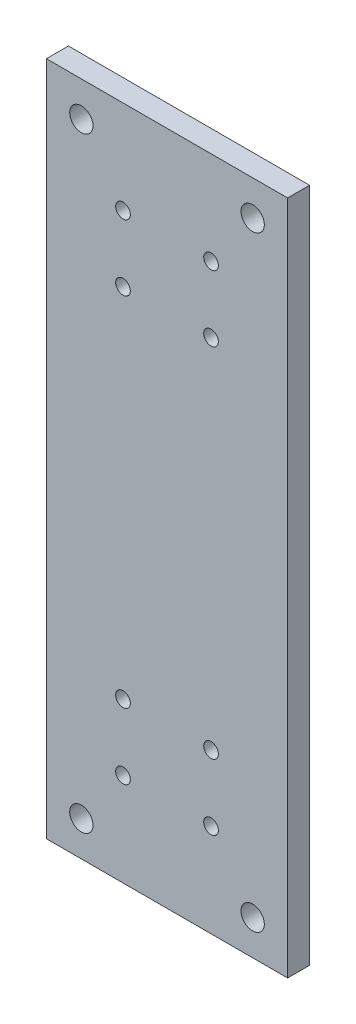
ISO-10303-21;
HEADER;
FILE_DESCRIPTION(('STEP AP214'),'2;1');
FILE_NAME('part.step','',(''),(''),'','','');
FILE_SCHEMA(('AUTOMOTIVE_DESIGN { 1 0 10303 214 1 1 1 1 }'));
ENDSEC;
DATA;
#1=APPLICATION_CONTEXT('core data for automotive mechanical design processes');
#2=APPLICATION_PROTOCOL_DEFINITION('international standard','automotive_design',2000,#1);
#3=PRODUCT_CONTEXT('',#1,'mechanical');
#4=PRODUCT('Part','Part','',(#3));
#5=PRODUCT_RELATED_PRODUCT_CATEGORY('part','',(#4));
#6=PRODUCT_DEFINITION_FORMATION('','',#4);
#7=PRODUCT_DEFINITION_CONTEXT('part definition',#1,'design');
#8=PRODUCT_DEFINITION('design','',#6,#7);
#9=PRODUCT_DEFINITION_SHAPE('','',#8);
#10=(LENGTH_UNIT() NAMED_UNIT(*) SI_UNIT(.MILLI.,.METRE.));
#11=(NAMED_UNIT(*) PLANE_ANGLE_UNIT() SI_UNIT($,.RADIAN.));
#12=(NAMED_UNIT(*) SI_UNIT($,.STERADIAN.) SOLID_ANGLE_UNIT());
#13=UNCERTAINTY_MEASURE_WITH_UNIT(LENGTH_MEASURE(1.E-05),#10,'distance_accuracy_value','');
#14=(GEOMETRIC_REPRESENTATION_CONTEXT(3) GLOBAL_UNCERTAINTY_ASSIGNED_CONTEXT((#13)) GLOBAL_UNIT_ASSIGNED_CONTEXT((#10,
#11,#12)) REPRESENTATION_CONTEXT('',''));
#15=CARTESIAN_POINT('',(0.,0.,0.));
#16=DIRECTION('',(0.,0.,1.));
#17=DIRECTION('',(1.,0.,0.));
#18=AXIS2_PLACEMENT_3D('',#15,#16,#17);
#19=CARTESIAN_POINT('',(0.,0.,5.9944));
#20=DIRECTION('',(0.,0.,-1.));
#21=DIRECTION('',(-1.,0.,0.));
#22=AXIS2_PLACEMENT_3D('',#19,#20,#21);
#23=PLANE('',#22);
#24=CARTESIAN_POINT('',(44.875,25.4,5.9944));
#25=DIRECTION('',(0.,0.,1.));
#26=DIRECTION('',(1.,0.,0.));
#27=AXIS2_PLACEMENT_3D('',#24,#25,#26);
#28=CIRCLE('',#27,2.);
#29=CARTESIAN_POINT('',(46.875,25.4,5.9944));
#30=VERTEX_POINT('',#29);
#31=EDGE_CURVE('E168',#30,#30,#28,.T.);
#32=ORIENTED_EDGE('',*,*,#31,.F.);
#33=EDGE_LOOP('',(#32));
#34=FACE_BOUND('',#33,.T.);
#35=CARTESIAN_POINT('',(20.875,43.4,5.9944));
#36=DIRECTION('',(0.,0.,1.));
#37=DIRECTION('',(1.,0.,0.));
#38=AXIS2_PLACEMENT_3D('',#35,#36,#37);
#39=CIRCLE('',#38,2.00000000000001);
#40=CARTESIAN_POINT('',(22.875,43.4,5.9944));
#41=VERTEX_POINT('',#40);
#42=EDGE_CURVE('E156',#41,#41,#39,.T.);
#43=ORIENTED_EDGE('',*,*,#42,.F.);
#44=EDGE_LOOP('',(#43));
#45=FACE_BOUND('',#44,.T.);
#46=CARTESIAN_POINT('',(44.875,140.75,5.9944));
#47=DIRECTION('',(0.,0.,1.));
#48=DIRECTION('',(1.,0.,0.));
#49=AXIS2_PLACEMENT_3D('',#46,#47,#48);
#50=CIRCLE('',#49,2.);
#51=CARTESIAN_POINT('',(46.875,140.75,5.9944));
#52=VERTEX_POINT('',#51);
#53=EDGE_CURVE('E144',#52,#52,#50,.T.);
#54=ORIENTED_EDGE('',*,*,#53,.F.);
#55=EDGE_LOOP('',(#54));
#56=FACE_BOUND('',#55,.T.);
#57=CARTESIAN_POINT('',(20.875,158.75,5.9944));
#58=DIRECTION('',(0.,0.,1.));
#59=DIRECTION('',(1.,0.,0.));
#60=AXIS2_PLACEMENT_3D('',#57,#58,#59);
#61=CIRCLE('',#60,2.);
#62=CARTESIAN_POINT('',(22.875,158.75,5.9944));
#63=VERTEX_POINT('',#62);
#64=EDGE_CURVE('E132',#63,#63,#61,.T.);
#65=ORIENTED_EDGE('',*,*,#64,.F.);
#66=EDGE_LOOP('',(#65));
#67=FACE_BOUND('',#66,.T.);
#68=CARTESIAN_POINT('',(56.225,174.625,5.9944));
#69=DIRECTION('',(0.,0.,1.));
#70=DIRECTION('',(1.,0.,0.));
#71=AXIS2_PLACEMENT_3D('',#68,#69,#70);
#72=CIRCLE('',#71,3.175);
#73=CARTESIAN_POINT('',(59.4,174.625,5.9944));
#74=VERTEX_POINT('',#73);
#75=EDGE_CURVE('E120',#74,#74,#72,.T.);
#76=ORIENTED_EDGE('',*,*,#75,.F.);
#77=EDGE_LOOP('',(#76));
#78=FACE_BOUND('',#77,.T.);
#79=CARTESIAN_POINT('',(9.525,9.525,5.9944));
#80=DIRECTION('',(0.,0.,1.));
#81=DIRECTION('',(1.,0.,0.));
#82=AXIS2_PLACEMENT_3D('',#79,#80,#81);
#83=CIRCLE('',#82,3.175);
#84=CARTESIAN_POINT('',(12.7,9.525,5.9944));
#85=VERTEX_POINT('',#84);
#86=EDGE_CURVE('E99',#85,#85,#83,.T.);
#87=ORIENTED_EDGE('',*,*,#86,.F.);
#88=EDGE_LOOP('',(#87));
#89=FACE_BOUND('',#88,.T.);
#90=DIRECTION('',(0.,-1.,0.));
#91=VECTOR('',#90,1.);
#92=CARTESIAN_POINT('',(0.,0.,5.9944));
#93=LINE('',#92,#91);
#94=CARTESIAN_POINT('',(0.,184.15,5.9944));
#95=VERTEX_POINT('',#94);
#96=CARTESIAN_POINT('',(0.,0.,5.9944));
#97=VERTEX_POINT('',#96);
#98=EDGE_CURVE('E84',#95,#97,#93,.T.);
#99=ORIENTED_EDGE('',*,*,#98,.T.);
#100=DIRECTION('',(1.,0.,0.));
#101=VECTOR('',#100,1.);
#102=CARTESIAN_POINT('',(0.,0.,5.9944));
#103=LINE('',#102,#101);
#104=CARTESIAN_POINT('',(65.75,0.,5.9944));
#105=VERTEX_POINT('',#104);
#106=EDGE_CURVE('E79',#97,#105,#103,.T.);
#107=ORIENTED_EDGE('',*,*,#106,.T.);
#108=DIRECTION('',(0.,1.,0.));
#109=VECTOR('',#108,1.);
#110=CARTESIAN_POINT('',(65.75,0.,5.9944));
#111=LINE('',#110,#109);
#112=CARTESIAN_POINT('',(65.75,184.15,5.9944));
#113=VERTEX_POINT('',#112);
#114=EDGE_CURVE('E82',#105,#113,#111,.T.);
#115=ORIENTED_EDGE('',*,*,#114,.T.);
#116=DIRECTION('',(-1.,0.,0.));
#117=VECTOR('',#116,1.);
#118=CARTESIAN_POINT('',(0.,184.15,5.9944));
#119=LINE('',#118,#117);
#120=EDGE_CURVE('E49',#113,#95,#119,.T.);
#121=ORIENTED_EDGE('',*,*,#120,.T.);
#122=EDGE_LOOP('',(#99,#107,#115,#121));
#123=FACE_BOUND('',#122,.T.);
#124=CARTESIAN_POINT('',(56.225,9.525,5.9944));
#125=DIRECTION('',(0.,0.,1.));
#126=DIRECTION('',(1.,0.,0.));
#127=AXIS2_PLACEMENT_3D('',#124,#125,#126);
#128=CIRCLE('',#127,3.175);
#129=CARTESIAN_POINT('',(59.4,9.525,5.9944));
#130=VERTEX_POINT('',#129);
#131=EDGE_CURVE('E114',#130,#130,#128,.T.);
#132=ORIENTED_EDGE('',*,*,#131,.F.);
#133=EDGE_LOOP('',(#132));
#134=FACE_BOUND('',#133,.T.);
#135=CARTESIAN_POINT('',(9.525,174.625,5.9944));
#136=DIRECTION('',(0.,0.,1.));
#137=DIRECTION('',(1.,0.,0.));
#138=AXIS2_PLACEMENT_3D('',#135,#136,#137);
#139=CIRCLE('',#138,3.175);
#140=CARTESIAN_POINT('',(12.7,174.625,5.9944));
#141=VERTEX_POINT('',#140);
#142=EDGE_CURVE('E126',#141,#141,#139,.T.);
#143=ORIENTED_EDGE('',*,*,#142,.F.);
#144=EDGE_LOOP('',(#143));
#145=FACE_BOUND('',#144,.T.);
#146=CARTESIAN_POINT('',(44.875,158.75,5.9944));
#147=DIRECTION('',(0.,0.,1.));
#148=DIRECTION('',(1.,0.,0.));
#149=AXIS2_PLACEMENT_3D('',#146,#147,#148);
#150=CIRCLE('',#149,2.);
#151=CARTESIAN_POINT('',(46.875,158.75,5.9944));
#152=VERTEX_POINT('',#151);
#153=EDGE_CURVE('E138',#152,#152,#150,.T.);
#154=ORIENTED_EDGE('',*,*,#153,.F.);
#155=EDGE_LOOP('',(#154));
#156=FACE_BOUND('',#155,.T.);
#157=CARTESIAN_POINT('',(20.875,140.75,5.9944));
#158=DIRECTION('',(0.,0.,1.));
#159=DIRECTION('',(1.,0.,0.));
#160=AXIS2_PLACEMENT_3D('',#157,#158,#159);
#161=CIRCLE('',#160,2.);
#162=CARTESIAN_POINT('',(22.875,140.75,5.9944));
#163=VERTEX_POINT('',#162);
#164=EDGE_CURVE('E150',#163,#163,#161,.T.);
#165=ORIENTED_EDGE('',*,*,#164,.F.);
#166=EDGE_LOOP('',(#165));
#167=FACE_BOUND('',#166,.T.);
#168=CARTESIAN_POINT('',(44.875,43.4,5.9944));
#169=DIRECTION('',(0.,0.,1.));
#170=DIRECTION('',(1.,0.,0.));
#171=AXIS2_PLACEMENT_3D('',#168,#169,#170);
#172=CIRCLE('',#171,2.);
#173=CARTESIAN_POINT('',(46.875,43.4,5.9944));
#174=VERTEX_POINT('',#173);
#175=EDGE_CURVE('E162',#174,#174,#172,.T.);
#176=ORIENTED_EDGE('',*,*,#175,.F.);
#177=EDGE_LOOP('',(#176));
#178=FACE_BOUND('',#177,.T.);
#179=CARTESIAN_POINT('',(20.875,25.4,5.9944));
#180=DIRECTION('',(0.,0.,1.));
#181=DIRECTION('',(1.,0.,0.));
#182=AXIS2_PLACEMENT_3D('',#179,#180,#181);
#183=CIRCLE('',#182,2.00000000000001);
#184=CARTESIAN_POINT('',(22.875,25.4,5.9944));
#185=VERTEX_POINT('',#184);
#186=EDGE_CURVE('E174',#185,#185,#183,.T.);
#187=ORIENTED_EDGE('',*,*,#186,.F.);
#188=EDGE_LOOP('',(#187));
#189=FACE_BOUND('',#188,.T.);
#190=ADVANCED_FACE('F32',(#34,#45,#56,#67,#78,#89,#123,#134,#145,#156,#167,#178,#189),#23,.F.);
#191=CARTESIAN_POINT('',(0.,0.,0.));
#192=DIRECTION('',(0.,0.,-1.));
#193=DIRECTION('',(-1.,0.,0.));
#194=AXIS2_PLACEMENT_3D('',#191,#192,#193);
#195=PLANE('',#194);
#196=CARTESIAN_POINT('',(44.875,25.4,0.));
#197=DIRECTION('',(0.,0.,1.));
#198=DIRECTION('',(1.,0.,0.));
#199=AXIS2_PLACEMENT_3D('',#196,#197,#198);
#200=CIRCLE('',#199,2.);
#201=CARTESIAN_POINT('',(46.875,25.4,0.));
#202=VERTEX_POINT('',#201);
#203=EDGE_CURVE('E171',#202,#202,#200,.T.);
#204=ORIENTED_EDGE('',*,*,#203,.T.);
#205=EDGE_LOOP('',(#204));
#206=FACE_BOUND('',#205,.T.);
#207=CARTESIAN_POINT('',(20.875,43.4,0.));
#208=DIRECTION('',(0.,0.,1.));
#209=DIRECTION('',(1.,0.,0.));
#210=AXIS2_PLACEMENT_3D('',#207,#208,#209);
#211=CIRCLE('',#210,2.00000000000001);
#212=CARTESIAN_POINT('',(22.875,43.4,0.));
#213=VERTEX_POINT('',#212);
#214=EDGE_CURVE('E159',#213,#213,#211,.T.);
#215=ORIENTED_EDGE('',*,*,#214,.T.);
#216=EDGE_LOOP('',(#215));
#217=FACE_BOUND('',#216,.T.);
#218=CARTESIAN_POINT('',(44.875,140.75,0.));
#219=DIRECTION('',(0.,0.,1.));
#220=DIRECTION('',(1.,0.,0.));
#221=AXIS2_PLACEMENT_3D('',#218,#219,#220);
#222=CIRCLE('',#221,2.);
#223=CARTESIAN_POINT('',(46.875,140.75,0.));
#224=VERTEX_POINT('',#223);
#225=EDGE_CURVE('E147',#224,#224,#222,.T.);
#226=ORIENTED_EDGE('',*,*,#225,.T.);
#227=EDGE_LOOP('',(#226));
#228=FACE_BOUND('',#227,.T.);
#229=CARTESIAN_POINT('',(20.875,158.75,0.));
#230=DIRECTION('',(0.,0.,1.));
#231=DIRECTION('',(1.,0.,0.));
#232=AXIS2_PLACEMENT_3D('',#229,#230,#231);
#233=CIRCLE('',#232,2.);
#234=CARTESIAN_POINT('',(22.875,158.75,0.));
#235=VERTEX_POINT('',#234);
#236=EDGE_CURVE('E135',#235,#235,#233,.T.);
#237=ORIENTED_EDGE('',*,*,#236,.T.);
#238=EDGE_LOOP('',(#237));
#239=FACE_BOUND('',#238,.T.);
#240=CARTESIAN_POINT('',(56.225,174.625,0.));
#241=DIRECTION('',(0.,0.,1.));
#242=DIRECTION('',(1.,0.,0.));
#243=AXIS2_PLACEMENT_3D('',#240,#241,#242);
#244=CIRCLE('',#243,3.175);
#245=CARTESIAN_POINT('',(59.4,174.625,0.));
#246=VERTEX_POINT('',#245);
#247=EDGE_CURVE('E123',#246,#246,#244,.T.);
#248=ORIENTED_EDGE('',*,*,#247,.T.);
#249=EDGE_LOOP('',(#248));
#250=FACE_BOUND('',#249,.T.);
#251=CARTESIAN_POINT('',(9.525,9.525,0.));
#252=DIRECTION('',(0.,0.,1.));
#253=DIRECTION('',(1.,0.,0.));
#254=AXIS2_PLACEMENT_3D('',#251,#252,#253);
#255=CIRCLE('',#254,3.175);
#256=CARTESIAN_POINT('',(12.7,9.525,0.));
#257=VERTEX_POINT('',#256);
#258=EDGE_CURVE('E111',#257,#257,#255,.T.);
#259=ORIENTED_EDGE('',*,*,#258,.T.);
#260=EDGE_LOOP('',(#259));
#261=FACE_BOUND('',#260,.T.);
#262=DIRECTION('',(0.,-1.,0.));
#263=VECTOR('',#262,1.);
#264=CARTESIAN_POINT('',(0.,0.,0.));
#265=LINE('',#264,#263);
#266=CARTESIAN_POINT('',(0.,184.15,0.));
#267=VERTEX_POINT('',#266);
#268=CARTESIAN_POINT('',(0.,0.,0.));
#269=VERTEX_POINT('',#268);
#270=EDGE_CURVE('E96',#267,#269,#265,.T.);
#271=ORIENTED_EDGE('',*,*,#270,.F.);
#272=DIRECTION('',(-1.,0.,0.));
#273=VECTOR('',#272,1.);
#274=CARTESIAN_POINT('',(0.,184.15,0.));
#275=LINE('',#274,#273);
#276=CARTESIAN_POINT('',(65.75,184.15,0.));
#277=VERTEX_POINT('',#276);
#278=EDGE_CURVE('E72',#277,#267,#275,.T.);
#279=ORIENTED_EDGE('',*,*,#278,.F.);
#280=DIRECTION('',(0.,1.,0.));
#281=VECTOR('',#280,1.);
#282=CARTESIAN_POINT('',(65.75,0.,0.));
#283=LINE('',#282,#281);
#284=CARTESIAN_POINT('',(65.75,0.,0.));
#285=VERTEX_POINT('',#284);
#286=EDGE_CURVE('E66',#285,#277,#283,.T.);
#287=ORIENTED_EDGE('',*,*,#286,.F.);
#288=DIRECTION('',(1.,0.,0.));
#289=VECTOR('',#288,1.);
#290=CARTESIAN_POINT('',(0.,0.,0.));
#291=LINE('',#290,#289);
#292=EDGE_CURVE('E88',#269,#285,#291,.T.);
#293=ORIENTED_EDGE('',*,*,#292,.F.);
#294=EDGE_LOOP('',(#271,#279,#287,#293));
#295=FACE_BOUND('',#294,.T.);
#296=CARTESIAN_POINT('',(56.225,9.525,0.));
#297=DIRECTION('',(0.,0.,1.));
#298=DIRECTION('',(1.,0.,0.));
#299=AXIS2_PLACEMENT_3D('',#296,#297,#298);
#300=CIRCLE('',#299,3.175);
#301=CARTESIAN_POINT('',(59.4,9.525,0.));
#302=VERTEX_POINT('',#301);
#303=EDGE_CURVE('E117',#302,#302,#300,.T.);
#304=ORIENTED_EDGE('',*,*,#303,.T.);
#305=EDGE_LOOP('',(#304));
#306=FACE_BOUND('',#305,.T.);
#307=CARTESIAN_POINT('',(9.525,174.625,0.));
#308=DIRECTION('',(0.,0.,1.));
#309=DIRECTION('',(1.,0.,0.));
#310=AXIS2_PLACEMENT_3D('',#307,#308,#309);
#311=CIRCLE('',#310,3.175);
#312=CARTESIAN_POINT('',(12.7,174.625,0.));
#313=VERTEX_POINT('',#312);
#314=EDGE_CURVE('E129',#313,#313,#311,.T.);
#315=ORIENTED_EDGE('',*,*,#314,.T.);
#316=EDGE_LOOP('',(#315));
#317=FACE_BOUND('',#316,.T.);
#318=CARTESIAN_POINT('',(44.875,158.75,0.));
#319=DIRECTION('',(0.,0.,1.));
#320=DIRECTION('',(1.,0.,0.));
#321=AXIS2_PLACEMENT_3D('',#318,#319,#320);
#322=CIRCLE('',#321,2.);
#323=CARTESIAN_POINT('',(46.875,158.75,0.));
#324=VERTEX_POINT('',#323);
#325=EDGE_CURVE('E141',#324,#324,#322,.T.);
#326=ORIENTED_EDGE('',*,*,#325,.T.);
#327=EDGE_LOOP('',(#326));
#328=FACE_BOUND('',#327,.T.);
#329=CARTESIAN_POINT('',(20.875,140.75,0.));
#330=DIRECTION('',(0.,0.,1.));
#331=DIRECTION('',(1.,0.,0.));
#332=AXIS2_PLACEMENT_3D('',#329,#330,#331);
#333=CIRCLE('',#332,2.);
#334=CARTESIAN_POINT('',(22.875,140.75,0.));
#335=VERTEX_POINT('',#334);
#336=EDGE_CURVE('E153',#335,#335,#333,.T.);
#337=ORIENTED_EDGE('',*,*,#336,.T.);
#338=EDGE_LOOP('',(#337));
#339=FACE_BOUND('',#338,.T.);
#340=CARTESIAN_POINT('',(44.875,43.4,0.));
#341=DIRECTION('',(0.,0.,1.));
#342=DIRECTION('',(1.,0.,0.));
#343=AXIS2_PLACEMENT_3D('',#340,#341,#342);
#344=CIRCLE('',#343,2.);
#345=CARTESIAN_POINT('',(46.875,43.4,0.));
#346=VERTEX_POINT('',#345);
#347=EDGE_CURVE('E165',#346,#346,#344,.T.);
#348=ORIENTED_EDGE('',*,*,#347,.T.);
#349=EDGE_LOOP('',(#348));
#350=FACE_BOUND('',#349,.T.);
#351=CARTESIAN_POINT('',(20.875,25.4,0.));
#352=DIRECTION('',(0.,0.,1.));
#353=DIRECTION('',(1.,0.,0.));
#354=AXIS2_PLACEMENT_3D('',#351,#352,#353);
#355=CIRCLE('',#354,2.00000000000001);
#356=CARTESIAN_POINT('',(22.875,25.4,0.));
#357=VERTEX_POINT('',#356);
#358=EDGE_CURVE('E177',#357,#357,#355,.T.);
#359=ORIENTED_EDGE('',*,*,#358,.T.);
#360=EDGE_LOOP('',(#359));
#361=FACE_BOUND('',#360,.T.);
#362=ADVANCED_FACE('F107',(#206,#217,#228,#239,#250,#261,#295,#306,#317,#328,#339,#350,#361),
#195,.T.);
#363=CARTESIAN_POINT('',(0.,0.,5.9944));
#364=DIRECTION('',(1.,0.,0.));
#365=DIRECTION('',(0.,0.,-1.));
#366=AXIS2_PLACEMENT_3D('',#363,#364,#365);
#367=PLANE('',#366);
#368=ORIENTED_EDGE('',*,*,#270,.T.);
#369=DIRECTION('',(0.,0.,-1.));
#370=VECTOR('',#369,1.);
#371=CARTESIAN_POINT('',(0.,0.,5.9944));
#372=LINE('',#371,#370);
#373=EDGE_CURVE('E11',#97,#269,#372,.T.);
#374=ORIENTED_EDGE('',*,*,#373,.F.);
#375=ORIENTED_EDGE('',*,*,#98,.F.);
#376=DIRECTION('',(0.,0.,-1.));
#377=VECTOR('',#376,1.);
#378=CARTESIAN_POINT('',(0.,184.15,5.9944));
#379=LINE('',#378,#377);
#380=EDGE_CURVE('E92',#95,#267,#379,.T.);
#381=ORIENTED_EDGE('',*,*,#380,.T.);
#382=EDGE_LOOP('',(#368,#374,#375,#381));
#383=FACE_BOUND('',#382,.T.);
#384=ADVANCED_FACE('F34',(#383),#367,.F.);
#385=CARTESIAN_POINT('',(0.,0.,5.9944));
#386=DIRECTION('',(0.,1.,0.));
#387=DIRECTION('',(0.,0.,1.));
#388=AXIS2_PLACEMENT_3D('',#385,#386,#387);
#389=PLANE('',#388);
#390=ORIENTED_EDGE('',*,*,#292,.T.);
#391=DIRECTION('',(0.,0.,-1.));
#392=VECTOR('',#391,1.);
#393=CARTESIAN_POINT('',(65.75,0.,5.9944));
#394=LINE('',#393,#392);
#395=EDGE_CURVE('E41',#105,#285,#394,.T.);
#396=ORIENTED_EDGE('',*,*,#395,.F.);
#397=ORIENTED_EDGE('',*,*,#106,.F.);
#398=ORIENTED_EDGE('',*,*,#373,.T.);
#399=EDGE_LOOP('',(#390,#396,#397,#398));
#400=FACE_BOUND('',#399,.T.);
#401=ADVANCED_FACE('F87',(#400),#389,.F.);
#402=CARTESIAN_POINT('',(65.75,0.,5.9944));
#403=DIRECTION('',(-1.,0.,0.));
#404=DIRECTION('',(0.,0.,1.));
#405=AXIS2_PLACEMENT_3D('',#402,#403,#404);
#406=PLANE('',#405);
#407=ORIENTED_EDGE('',*,*,#286,.T.);
#408=DIRECTION('',(0.,0.,-1.));
#409=VECTOR('',#408,1.);
#410=CARTESIAN_POINT('',(65.75,184.15,5.9944));
#411=LINE('',#410,#409);
#412=EDGE_CURVE('E89',#113,#277,#411,.T.);
#413=ORIENTED_EDGE('',*,*,#412,.F.);
#414=ORIENTED_EDGE('',*,*,#114,.F.);
#415=ORIENTED_EDGE('',*,*,#395,.T.);
#416=EDGE_LOOP('',(#407,#413,#414,#415));
#417=FACE_BOUND('',#416,.T.);
#418=ADVANCED_FACE('F90',(#417),#406,.F.);
#419=CARTESIAN_POINT('',(0.,184.15,5.9944));
#420=DIRECTION('',(0.,-1.,0.));
#421=DIRECTION('',(0.,0.,-1.));
#422=AXIS2_PLACEMENT_3D('',#419,#420,#421);
#423=PLANE('',#422);
#424=ORIENTED_EDGE('',*,*,#278,.T.);
#425=ORIENTED_EDGE('',*,*,#380,.F.);
#426=ORIENTED_EDGE('',*,*,#120,.F.);
#427=ORIENTED_EDGE('',*,*,#412,.T.);
#428=EDGE_LOOP('',(#424,#425,#426,#427));
#429=FACE_BOUND('',#428,.T.);
#430=ADVANCED_FACE('F104',(#429),#423,.F.);
#431=CARTESIAN_POINT('',(9.525,9.525,5.9944));
#432=DIRECTION('',(0.,0.,-1.));
#433=DIRECTION('',(-1.,0.,0.));
#434=AXIS2_PLACEMENT_3D('',#431,#432,#433);
#435=CYLINDRICAL_SURFACE('',#434,3.175);
#436=ORIENTED_EDGE('',*,*,#86,.T.);
#437=EDGE_LOOP('',(#436));
#438=FACE_BOUND('',#437,.T.);
#439=ORIENTED_EDGE('',*,*,#258,.F.);
#440=EDGE_LOOP('',(#439));
#441=FACE_BOUND('',#440,.T.);
#442=ADVANCED_FACE('F197',(#438,#441),#435,.F.);
#443=CARTESIAN_POINT('',(56.225,9.525,5.9944));
#444=DIRECTION('',(0.,0.,-1.));
#445=DIRECTION('',(-1.,0.,0.));
#446=AXIS2_PLACEMENT_3D('',#443,#444,#445);
#447=CYLINDRICAL_SURFACE('',#446,3.175);
#448=ORIENTED_EDGE('',*,*,#131,.T.);
#449=EDGE_LOOP('',(#448));
#450=FACE_BOUND('',#449,.T.);
#451=ORIENTED_EDGE('',*,*,#303,.F.);
#452=EDGE_LOOP('',(#451));
#453=FACE_BOUND('',#452,.T.);
#454=ADVANCED_FACE('F243',(#450,#453),#447,.F.);
#455=CARTESIAN_POINT('',(56.225,174.625,5.9944));
#456=DIRECTION('',(0.,0.,-1.));
#457=DIRECTION('',(-1.,0.,0.));
#458=AXIS2_PLACEMENT_3D('',#455,#456,#457);
#459=CYLINDRICAL_SURFACE('',#458,3.175);
#460=ORIENTED_EDGE('',*,*,#75,.T.);
#461=EDGE_LOOP('',(#460));
#462=FACE_BOUND('',#461,.T.);
#463=ORIENTED_EDGE('',*,*,#247,.F.);
#464=EDGE_LOOP('',(#463));
#465=FACE_BOUND('',#464,.T.);
#466=ADVANCED_FACE('F251',(#462,#465),#459,.F.);
#467=CARTESIAN_POINT('',(9.525,174.625,5.9944));
#468=DIRECTION('',(0.,0.,-1.));
#469=DIRECTION('',(-1.,0.,0.));
#470=AXIS2_PLACEMENT_3D('',#467,#468,#469);
#471=CYLINDRICAL_SURFACE('',#470,3.175);
#472=ORIENTED_EDGE('',*,*,#142,.T.);
#473=EDGE_LOOP('',(#472));
#474=FACE_BOUND('',#473,.T.);
#475=ORIENTED_EDGE('',*,*,#314,.F.);
#476=EDGE_LOOP('',(#475));
#477=FACE_BOUND('',#476,.T.);
#478=ADVANCED_FACE('F259',(#474,#477),#471,.F.);
#479=CARTESIAN_POINT('',(20.875,158.75,5.9944));
#480=DIRECTION('',(0.,0.,-1.));
#481=DIRECTION('',(-1.,0.,0.));
#482=AXIS2_PLACEMENT_3D('',#479,#480,#481);
#483=CYLINDRICAL_SURFACE('',#482,2.);
#484=ORIENTED_EDGE('',*,*,#64,.T.);
#485=EDGE_LOOP('',(#484));
#486=FACE_BOUND('',#485,.T.);
#487=ORIENTED_EDGE('',*,*,#236,.F.);
#488=EDGE_LOOP('',(#487));
#489=FACE_BOUND('',#488,.T.);
#490=ADVANCED_FACE('F268',(#486,#489),#483,.F.);
#491=CARTESIAN_POINT('',(44.875,158.75,5.9944));
#492=DIRECTION('',(0.,0.,-1.));
#493=DIRECTION('',(-1.,0.,0.));
#494=AXIS2_PLACEMENT_3D('',#491,#492,#493);
#495=CYLINDRICAL_SURFACE('',#494,2.);
#496=ORIENTED_EDGE('',*,*,#153,.T.);
#497=EDGE_LOOP('',(#496));
#498=FACE_BOUND('',#497,.T.);
#499=ORIENTED_EDGE('',*,*,#325,.F.);
#500=EDGE_LOOP('',(#499));
#501=FACE_BOUND('',#500,.T.);
#502=ADVANCED_FACE('F277',(#498,#501),#495,.F.);
#503=CARTESIAN_POINT('',(44.875,140.75,5.9944));
#504=DIRECTION('',(0.,0.,-1.));
#505=DIRECTION('',(-1.,0.,0.));
#506=AXIS2_PLACEMENT_3D('',#503,#504,#505);
#507=CYLINDRICAL_SURFACE('',#506,2.);
#508=ORIENTED_EDGE('',*,*,#53,.T.);
#509=EDGE_LOOP('',(#508));
#510=FACE_BOUND('',#509,.T.);
#511=ORIENTED_EDGE('',*,*,#225,.F.);
#512=EDGE_LOOP('',(#511));
#513=FACE_BOUND('',#512,.T.);
#514=ADVANCED_FACE('F286',(#510,#513),#507,.F.);
#515=CARTESIAN_POINT('',(20.875,140.75,5.9944));
#516=DIRECTION('',(0.,0.,-1.));
#517=DIRECTION('',(-1.,0.,0.));
#518=AXIS2_PLACEMENT_3D('',#515,#516,#517);
#519=CYLINDRICAL_SURFACE('',#518,2.);
#520=ORIENTED_EDGE('',*,*,#164,.T.);
#521=EDGE_LOOP('',(#520));
#522=FACE_BOUND('',#521,.T.);
#523=ORIENTED_EDGE('',*,*,#336,.F.);
#524=EDGE_LOOP('',(#523));
#525=FACE_BOUND('',#524,.T.);
#526=ADVANCED_FACE('F295',(#522,#525),#519,.F.);
#527=CARTESIAN_POINT('',(20.875,43.4,5.9944));
#528=DIRECTION('',(0.,0.,-1.));
#529=DIRECTION('',(-1.,0.,0.));
#530=AXIS2_PLACEMENT_3D('',#527,#528,#529);
#531=CYLINDRICAL_SURFACE('',#530,2.00000000000001);
#532=ORIENTED_EDGE('',*,*,#42,.T.);
#533=EDGE_LOOP('',(#532));
#534=FACE_BOUND('',#533,.T.);
#535=ORIENTED_EDGE('',*,*,#214,.F.);
#536=EDGE_LOOP('',(#535));
#537=FACE_BOUND('',#536,.T.);
#538=ADVANCED_FACE('F304',(#534,#537),#531,.F.);
#539=CARTESIAN_POINT('',(44.875,43.4,5.9944));
#540=DIRECTION('',(0.,0.,-1.));
#541=DIRECTION('',(-1.,0.,0.));
#542=AXIS2_PLACEMENT_3D('',#539,#540,#541);
#543=CYLINDRICAL_SURFACE('',#542,2.);
#544=ORIENTED_EDGE('',*,*,#175,.T.);
#545=EDGE_LOOP('',(#544));
#546=FACE_BOUND('',#545,.T.);
#547=ORIENTED_EDGE('',*,*,#347,.F.);
#548=EDGE_LOOP('',(#547));
#549=FACE_BOUND('',#548,.T.);
#550=ADVANCED_FACE('F313',(#546,#549),#543,.F.);
#551=CARTESIAN_POINT('',(44.875,25.4,5.9944));
#552=DIRECTION('',(0.,0.,-1.));
#553=DIRECTION('',(-1.,0.,0.));
#554=AXIS2_PLACEMENT_3D('',#551,#552,#553);
#555=CYLINDRICAL_SURFACE('',#554,2.);
#556=ORIENTED_EDGE('',*,*,#31,.T.);
#557=EDGE_LOOP('',(#556));
#558=FACE_BOUND('',#557,.T.);
#559=ORIENTED_EDGE('',*,*,#203,.F.);
#560=EDGE_LOOP('',(#559));
#561=FACE_BOUND('',#560,.T.);
#562=ADVANCED_FACE('F322',(#558,#561),#555,.F.);
#563=CARTESIAN_POINT('',(20.875,25.4,5.9944));
#564=DIRECTION('',(0.,0.,-1.));
#565=DIRECTION('',(-1.,0.,0.));
#566=AXIS2_PLACEMENT_3D('',#563,#564,#565);
#567=CYLINDRICAL_SURFACE('',#566,2.00000000000001);
#568=ORIENTED_EDGE('',*,*,#186,.T.);
#569=EDGE_LOOP('',(#568));
#570=FACE_BOUND('',#569,.T.);
#571=ORIENTED_EDGE('',*,*,#358,.F.);
#572=EDGE_LOOP('',(#571));
#573=FACE_BOUND('',#572,.T.);
#574=ADVANCED_FACE('F183',(#570,#573),#567,.F.);
#575=CLOSED_SHELL('',(#190,#362,#384,#401,#418,#430,#442,#454,#466,#478,#490,#502,#514,#526,
#538,#550,#562,#574));
#576=MANIFOLD_SOLID_BREP('B2',#575);
#577=ADVANCED_BREP_SHAPE_REPRESENTATION('',(#18,#576),#14);
#578=SHAPE_DEFINITION_REPRESENTATION(#9,#577);
ENDSEC;
END-ISO-10303-21;
